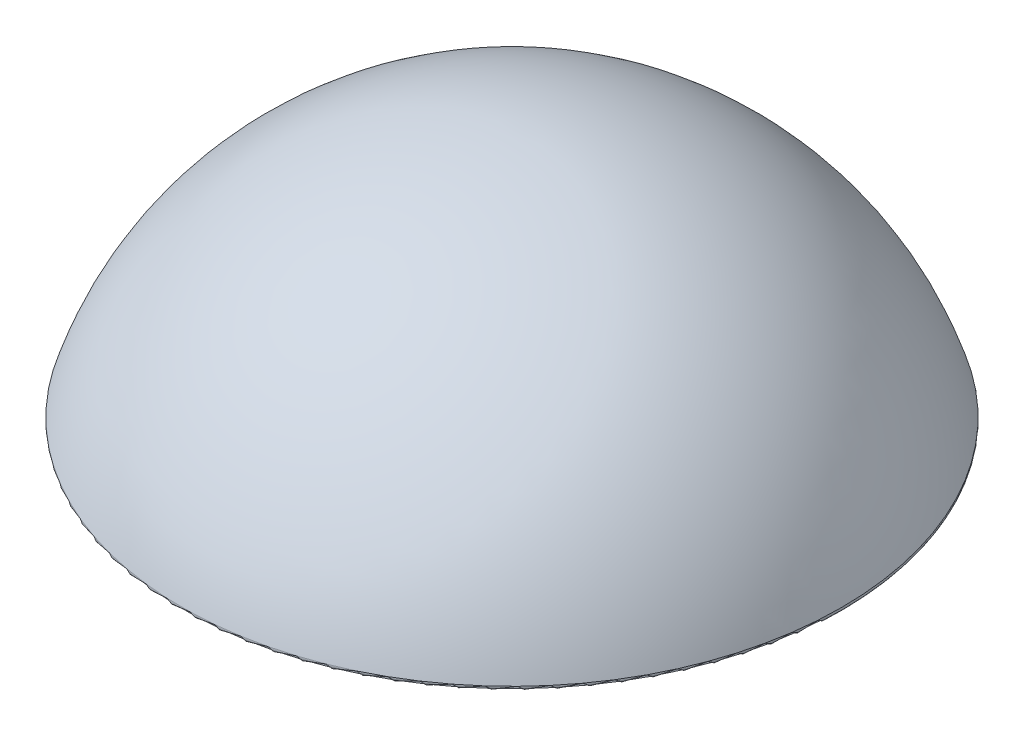
ISO-10303-21;
HEADER;
FILE_DESCRIPTION(('STEP AP214'),'2;1');
FILE_NAME('part.step','',(''),(''),'','','');
FILE_SCHEMA(('AUTOMOTIVE_DESIGN { 1 0 10303 214 1 1 1 1 }'));
ENDSEC;
DATA;
#1=APPLICATION_CONTEXT('core data for automotive mechanical design processes');
#2=APPLICATION_PROTOCOL_DEFINITION('international standard','automotive_design',2000,#1);
#3=PRODUCT_CONTEXT('',#1,'mechanical');
#4=PRODUCT('Part','Part','',(#3));
#5=PRODUCT_RELATED_PRODUCT_CATEGORY('part','',(#4));
#6=PRODUCT_DEFINITION_FORMATION('','',#4);
#7=PRODUCT_DEFINITION_CONTEXT('part definition',#1,'design');
#8=PRODUCT_DEFINITION('design','',#6,#7);
#9=PRODUCT_DEFINITION_SHAPE('','',#8);
#10=(LENGTH_UNIT() NAMED_UNIT(*) SI_UNIT(.MILLI.,.METRE.));
#11=(NAMED_UNIT(*) PLANE_ANGLE_UNIT() SI_UNIT($,.RADIAN.));
#12=(NAMED_UNIT(*) SI_UNIT($,.STERADIAN.) SOLID_ANGLE_UNIT());
#13=UNCERTAINTY_MEASURE_WITH_UNIT(LENGTH_MEASURE(1.E-05),#10,'distance_accuracy_value','');
#14=(GEOMETRIC_REPRESENTATION_CONTEXT(3) GLOBAL_UNCERTAINTY_ASSIGNED_CONTEXT((#13)) GLOBAL_UNIT_ASSIGNED_CONTEXT((#10,
#11,#12)) REPRESENTATION_CONTEXT('',''));
#15=CARTESIAN_POINT('',(0.,0.,0.));
#16=DIRECTION('',(0.,0.,1.));
#17=DIRECTION('',(1.,0.,0.));
#18=AXIS2_PLACEMENT_3D('',#15,#16,#17);
#19=CARTESIAN_POINT('',(0.,0.,0.));
#20=DIRECTION('',(0.,-1.,0.));
#21=DIRECTION('',(0.,0.,-1.));
#22=AXIS2_PLACEMENT_3D('',#19,#20,#21);
#23=PLANE('',#22);
#24=CARTESIAN_POINT('',(0.,0.,0.));
#25=DIRECTION('',(0.,-1.,0.));
#26=DIRECTION('',(0.,0.,-1.));
#27=AXIS2_PLACEMENT_3D('',#24,#25,#26);
#28=CIRCLE('',#27,49.3281070616882);
#29=CARTESIAN_POINT('',(0.,0.,-49.3281070616882));
#30=VERTEX_POINT('',#29);
#31=EDGE_CURVE('E40',#30,#30,#28,.T.);
#32=ORIENTED_EDGE('',*,*,#31,.T.);
#33=EDGE_LOOP('',(#32));
#34=FACE_BOUND('',#33,.T.);
#35=ADVANCED_FACE('F33',(#34),#23,.T.);
#36=CARTESIAN_POINT('',(0.,-14.6389268553123,0.));
#37=DIRECTION('',(0.,-1.,0.));
#38=DIRECTION('',(1.,0.,0.));
#39=AXIS2_PLACEMENT_3D('',#36,#37,#38);
#40=SPHERICAL_SURFACE('',#39,52.0989268553123);
#41=CARTESIAN_POINT('',(0.,0.646698078603103,0.));
#42=DIRECTION('',(0.,-1.,0.));
#43=DIRECTION('',(0.,0.,-1.));
#44=AXIS2_PLACEMENT_3D('',#41,#42,#43);
#45=CIRCLE('',#44,49.8061025362841);
#46=CARTESIAN_POINT('',(0.,0.646698078603103,-49.8061025362841));
#47=VERTEX_POINT('',#46);
#48=EDGE_CURVE('E10',#47,#47,#45,.F.);
#49=ORIENTED_EDGE('',*,*,#48,.T.);
#50=EDGE_LOOP('',(#49));
#51=FACE_BOUND('',#50,.T.);
#52=ADVANCED_FACE('F48',(#51),#40,.T.);
#53=CARTESIAN_POINT('',(0.,0.500000000000002,0.));
#54=DIRECTION('',(0.,-1.,0.));
#55=DIRECTION('',(0.,0.,-1.));
#56=AXIS2_PLACEMENT_3D('',#53,#54,#55);
#57=TOROIDAL_SURFACE('',#56,49.3281070616882,0.5);
#58=ORIENTED_EDGE('',*,*,#48,.F.);
#59=EDGE_LOOP('',(#58));
#60=FACE_BOUND('',#59,.T.);
#61=ORIENTED_EDGE('',*,*,#31,.F.);
#62=EDGE_LOOP('',(#61));
#63=FACE_BOUND('',#62,.T.);
#64=ADVANCED_FACE('F35',(#60,#63),#57,.T.);
#65=CLOSED_SHELL('',(#35,#52,#64));
#66=MANIFOLD_SOLID_BREP('B2',#65);
#67=ADVANCED_BREP_SHAPE_REPRESENTATION('',(#18,#66),#14);
#68=SHAPE_DEFINITION_REPRESENTATION(#9,#67);
ENDSEC;
END-ISO-10303-21;
